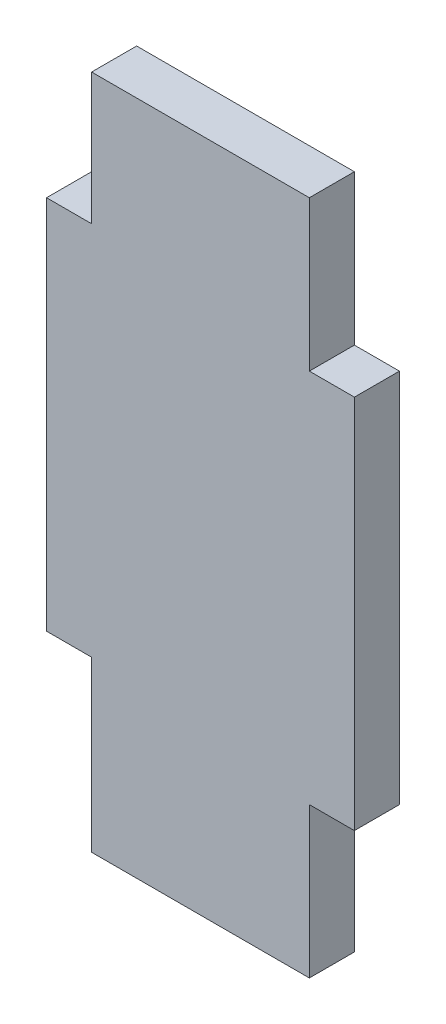
ISO-10303-21;
HEADER;
FILE_DESCRIPTION(('STEP AP214'),'2;1');
FILE_NAME('part.step','',(''),(''),'','','');
FILE_SCHEMA(('AUTOMOTIVE_DESIGN { 1 0 10303 214 1 1 1 1 }'));
ENDSEC;
DATA;
#1=APPLICATION_CONTEXT('core data for automotive mechanical design processes');
#2=APPLICATION_PROTOCOL_DEFINITION('international standard','automotive_design',2000,#1);
#3=PRODUCT_CONTEXT('',#1,'mechanical');
#4=PRODUCT('Part','Part','',(#3));
#5=PRODUCT_RELATED_PRODUCT_CATEGORY('part','',(#4));
#6=PRODUCT_DEFINITION_FORMATION('','',#4);
#7=PRODUCT_DEFINITION_CONTEXT('part definition',#1,'design');
#8=PRODUCT_DEFINITION('design','',#6,#7);
#9=PRODUCT_DEFINITION_SHAPE('','',#8);
#10=(LENGTH_UNIT() NAMED_UNIT(*) SI_UNIT(.MILLI.,.METRE.));
#11=(NAMED_UNIT(*) PLANE_ANGLE_UNIT() SI_UNIT($,.RADIAN.));
#12=(NAMED_UNIT(*) SI_UNIT($,.STERADIAN.) SOLID_ANGLE_UNIT());
#13=UNCERTAINTY_MEASURE_WITH_UNIT(LENGTH_MEASURE(1.E-05),#10,'distance_accuracy_value','');
#14=(GEOMETRIC_REPRESENTATION_CONTEXT(3) GLOBAL_UNCERTAINTY_ASSIGNED_CONTEXT((#13)) GLOBAL_UNIT_ASSIGNED_CONTEXT((#10,
#11,#12)) REPRESENTATION_CONTEXT('',''));
#15=CARTESIAN_POINT('',(0.,0.,0.));
#16=DIRECTION('',(0.,0.,1.));
#17=DIRECTION('',(1.,0.,0.));
#18=AXIS2_PLACEMENT_3D('',#15,#16,#17);
#19=CARTESIAN_POINT('',(-47.7707289927657,27.2916666666667,3.));
#20=DIRECTION('',(1.,0.,0.));
#21=DIRECTION('',(0.,0.,-1.));
#22=AXIS2_PLACEMENT_3D('',#19,#20,#21);
#23=PLANE('',#22);
#24=DIRECTION('',(0.,-1.,0.));
#25=VECTOR('',#24,1.);
#26=CARTESIAN_POINT('',(-47.7707289927657,27.2916666666667,0.));
#27=LINE('',#26,#25);
#28=CARTESIAN_POINT('',(-47.7707289927657,27.2916666666667,0.));
#29=VERTEX_POINT('',#28);
#30=CARTESIAN_POINT('',(-47.7707289927657,18.5416666666667,0.));
#31=VERTEX_POINT('',#30);
#32=EDGE_CURVE('E180',#29,#31,#27,.T.);
#33=ORIENTED_EDGE('',*,*,#32,.T.);
#34=DIRECTION('',(0.,0.,-1.));
#35=VECTOR('',#34,1.);
#36=CARTESIAN_POINT('',(-47.7707289927657,18.5416666666667,3.));
#37=LINE('',#36,#35);
#38=CARTESIAN_POINT('',(-47.7707289927657,18.5416666666667,3.));
#39=VERTEX_POINT('',#38);
#40=EDGE_CURVE('E11',#39,#31,#37,.T.);
#41=ORIENTED_EDGE('',*,*,#40,.F.);
#42=DIRECTION('',(0.,-1.,0.));
#43=VECTOR('',#42,1.);
#44=CARTESIAN_POINT('',(-47.7707289927657,27.2916666666667,3.));
#45=LINE('',#44,#43);
#46=CARTESIAN_POINT('',(-47.7707289927657,27.2916666666667,3.));
#47=VERTEX_POINT('',#46);
#48=EDGE_CURVE('E144',#47,#39,#45,.T.);
#49=ORIENTED_EDGE('',*,*,#48,.F.);
#50=DIRECTION('',(0.,0.,-1.));
#51=VECTOR('',#50,1.);
#52=CARTESIAN_POINT('',(-47.7707289927657,27.2916666666667,3.));
#53=LINE('',#52,#51);
#54=EDGE_CURVE('E151',#47,#29,#53,.T.);
#55=ORIENTED_EDGE('',*,*,#54,.T.);
#56=EDGE_LOOP('',(#33,#41,#49,#55));
#57=FACE_BOUND('',#56,.T.);
#58=ADVANCED_FACE('F33',(#57),#23,.F.);
#59=CARTESIAN_POINT('',(-47.7707289927657,18.5416666666667,3.));
#60=DIRECTION('',(0.,-1.,0.));
#61=DIRECTION('',(1.,0.,0.));
#62=AXIS2_PLACEMENT_3D('',#59,#60,#61);
#63=PLANE('',#62);
#64=DIRECTION('',(-1.,0.,0.));
#65=VECTOR('',#64,1.);
#66=CARTESIAN_POINT('',(-47.7707289927657,18.5416666666667,0.));
#67=LINE('',#66,#65);
#68=CARTESIAN_POINT('',(-50.7707289927657,18.5416666666667,0.));
#69=VERTEX_POINT('',#68);
#70=EDGE_CURVE('E175',#31,#69,#67,.T.);
#71=ORIENTED_EDGE('',*,*,#70,.T.);
#72=DIRECTION('',(0.,0.,-1.));
#73=VECTOR('',#72,1.);
#74=CARTESIAN_POINT('',(-50.7707289927657,18.5416666666667,3.));
#75=LINE('',#74,#73);
#76=CARTESIAN_POINT('',(-50.7707289927657,18.5416666666667,3.));
#77=VERTEX_POINT('',#76);
#78=EDGE_CURVE('E40',#77,#69,#75,.T.);
#79=ORIENTED_EDGE('',*,*,#78,.F.);
#80=DIRECTION('',(-1.,0.,0.));
#81=VECTOR('',#80,1.);
#82=CARTESIAN_POINT('',(-47.7707289927657,18.5416666666667,3.));
#83=LINE('',#82,#81);
#84=EDGE_CURVE('E220',#39,#77,#83,.T.);
#85=ORIENTED_EDGE('',*,*,#84,.F.);
#86=ORIENTED_EDGE('',*,*,#40,.T.);
#87=EDGE_LOOP('',(#71,#79,#85,#86));
#88=FACE_BOUND('',#87,.T.);
#89=ADVANCED_FACE('F258',(#88),#63,.F.);
#90=CARTESIAN_POINT('',(-50.7707289927657,-6.45833333333334,3.));
#91=DIRECTION('',(1.,0.,0.));
#92=DIRECTION('',(0.,0.,-1.));
#93=AXIS2_PLACEMENT_3D('',#90,#91,#92);
#94=PLANE('',#93);
#95=DIRECTION('',(0.,-1.,0.));
#96=VECTOR('',#95,1.);
#97=CARTESIAN_POINT('',(-50.7707289927657,-6.45833333333334,0.));
#98=LINE('',#97,#96);
#99=CARTESIAN_POINT('',(-50.7707289927657,-6.45833333333334,0.));
#100=VERTEX_POINT('',#99);
#101=EDGE_CURVE('E170',#69,#100,#98,.T.);
#102=ORIENTED_EDGE('',*,*,#101,.T.);
#103=DIRECTION('',(0.,0.,-1.));
#104=VECTOR('',#103,1.);
#105=CARTESIAN_POINT('',(-50.7707289927657,-6.45833333333334,3.));
#106=LINE('',#105,#104);
#107=CARTESIAN_POINT('',(-50.7707289927657,-6.45833333333334,3.));
#108=VERTEX_POINT('',#107);
#109=EDGE_CURVE('E161',#108,#100,#106,.T.);
#110=ORIENTED_EDGE('',*,*,#109,.F.);
#111=DIRECTION('',(0.,-1.,0.));
#112=VECTOR('',#111,1.);
#113=CARTESIAN_POINT('',(-50.7707289927657,-6.45833333333334,3.));
#114=LINE('',#113,#112);
#115=EDGE_CURVE('E171',#77,#108,#114,.T.);
#116=ORIENTED_EDGE('',*,*,#115,.F.);
#117=ORIENTED_EDGE('',*,*,#78,.T.);
#118=EDGE_LOOP('',(#102,#110,#116,#117));
#119=FACE_BOUND('',#118,.T.);
#120=ADVANCED_FACE('F168',(#119),#94,.F.);
#121=CARTESIAN_POINT('',(-47.7707289927657,-6.45833333333334,3.));
#122=DIRECTION('',(0.,1.,0.));
#123=DIRECTION('',(0.,0.,1.));
#124=AXIS2_PLACEMENT_3D('',#121,#122,#123);
#125=PLANE('',#124);
#126=DIRECTION('',(1.,0.,0.));
#127=VECTOR('',#126,1.);
#128=CARTESIAN_POINT('',(-47.7707289927657,-6.45833333333334,0.));
#129=LINE('',#128,#127);
#130=CARTESIAN_POINT('',(-47.7707289927657,-6.45833333333334,0.));
#131=VERTEX_POINT('',#130);
#132=EDGE_CURVE('E177',#100,#131,#129,.T.);
#133=ORIENTED_EDGE('',*,*,#132,.T.);
#134=DIRECTION('',(0.,0.,-1.));
#135=VECTOR('',#134,1.);
#136=CARTESIAN_POINT('',(-47.7707289927657,-6.45833333333334,3.));
#137=LINE('',#136,#135);
#138=CARTESIAN_POINT('',(-47.7707289927657,-6.45833333333334,3.));
#139=VERTEX_POINT('',#138);
#140=EDGE_CURVE('E158',#139,#131,#137,.T.);
#141=ORIENTED_EDGE('',*,*,#140,.F.);
#142=DIRECTION('',(1.,0.,0.));
#143=VECTOR('',#142,1.);
#144=CARTESIAN_POINT('',(-47.7707289927657,-6.45833333333334,3.));
#145=LINE('',#144,#143);
#146=EDGE_CURVE('E223',#108,#139,#145,.T.);
#147=ORIENTED_EDGE('',*,*,#146,.F.);
#148=ORIENTED_EDGE('',*,*,#109,.T.);
#149=EDGE_LOOP('',(#133,#141,#147,#148));
#150=FACE_BOUND('',#149,.T.);
#151=ADVANCED_FACE('F265',(#150),#125,.F.);
#152=CARTESIAN_POINT('',(-47.7707289927657,-6.45833333333334,3.));
#153=DIRECTION('',(1.,0.,0.));
#154=DIRECTION('',(0.,0.,-1.));
#155=AXIS2_PLACEMENT_3D('',#152,#153,#154);
#156=PLANE('',#155);
#157=DIRECTION('',(0.,-1.,0.));
#158=VECTOR('',#157,1.);
#159=CARTESIAN_POINT('',(-47.7707289927657,-6.45833333333334,0.));
#160=LINE('',#159,#158);
#161=CARTESIAN_POINT('',(-47.7707289927657,-17.7083333333333,0.));
#162=VERTEX_POINT('',#161);
#163=EDGE_CURVE('E147',#131,#162,#160,.T.);
#164=ORIENTED_EDGE('',*,*,#163,.T.);
#165=DIRECTION('',(0.,0.,-1.));
#166=VECTOR('',#165,1.);
#167=CARTESIAN_POINT('',(-47.7707289927657,-17.7083333333333,3.));
#168=LINE('',#167,#166);
#169=CARTESIAN_POINT('',(-47.7707289927657,-17.7083333333333,3.));
#170=VERTEX_POINT('',#169);
#171=EDGE_CURVE('E154',#170,#162,#168,.T.);
#172=ORIENTED_EDGE('',*,*,#171,.F.);
#173=DIRECTION('',(0.,-1.,0.));
#174=VECTOR('',#173,1.);
#175=CARTESIAN_POINT('',(-47.7707289927657,-6.45833333333334,3.));
#176=LINE('',#175,#174);
#177=EDGE_CURVE('E225',#139,#170,#176,.T.);
#178=ORIENTED_EDGE('',*,*,#177,.F.);
#179=ORIENTED_EDGE('',*,*,#140,.T.);
#180=EDGE_LOOP('',(#164,#172,#178,#179));
#181=FACE_BOUND('',#180,.T.);
#182=ADVANCED_FACE('F185',(#181),#156,.F.);
#183=CARTESIAN_POINT('',(-47.7707289927657,-17.7083333333333,3.));
#184=DIRECTION('',(0.,1.,0.));
#185=DIRECTION('',(-1.,0.,0.));
#186=AXIS2_PLACEMENT_3D('',#183,#184,#185);
#187=PLANE('',#186);
#188=DIRECTION('',(1.,0.,0.));
#189=VECTOR('',#188,1.);
#190=CARTESIAN_POINT('',(-47.7707289927657,-17.7083333333333,0.));
#191=LINE('',#190,#189);
#192=CARTESIAN_POINT('',(-33.2707289927657,-17.7083333333333,0.));
#193=VERTEX_POINT('',#192);
#194=EDGE_CURVE('E142',#162,#193,#191,.T.);
#195=ORIENTED_EDGE('',*,*,#194,.T.);
#196=DIRECTION('',(0.,0.,1.));
#197=VECTOR('',#196,1.);
#198=CARTESIAN_POINT('',(-33.2707289927657,-17.7083333333333,0.));
#199=LINE('',#198,#197);
#200=CARTESIAN_POINT('',(-33.2707289927657,-17.7083333333333,3.));
#201=VERTEX_POINT('',#200);
#202=EDGE_CURVE('E200',#193,#201,#199,.T.);
#203=ORIENTED_EDGE('',*,*,#202,.T.);
#204=DIRECTION('',(1.,0.,0.));
#205=VECTOR('',#204,1.);
#206=CARTESIAN_POINT('',(-47.7707289927657,-17.7083333333333,3.));
#207=LINE('',#206,#205);
#208=EDGE_CURVE('E194',#170,#201,#207,.T.);
#209=ORIENTED_EDGE('',*,*,#208,.F.);
#210=ORIENTED_EDGE('',*,*,#171,.T.);
#211=EDGE_LOOP('',(#195,#203,#209,#210));
#212=FACE_BOUND('',#211,.T.);
#213=ADVANCED_FACE('F191',(#212),#187,.F.);
#214=CARTESIAN_POINT('',(-30.2707289927657,27.2916666666667,3.));
#215=DIRECTION('',(-1.,0.,0.));
#216=DIRECTION('',(0.,-1.,0.));
#217=AXIS2_PLACEMENT_3D('',#214,#215,#216);
#218=PLANE('',#217);
#219=DIRECTION('',(0.,1.,0.));
#220=VECTOR('',#219,1.);
#221=CARTESIAN_POINT('',(-30.2707289927657,27.2916666666667,3.));
#222=LINE('',#221,#220);
#223=CARTESIAN_POINT('',(-30.2707289927657,-7.70833333333333,3.));
#224=VERTEX_POINT('',#223);
#225=CARTESIAN_POINT('',(-30.2707289927657,17.2916666666667,3.));
#226=VERTEX_POINT('',#225);
#227=EDGE_CURVE('E137',#224,#226,#222,.T.);
#228=ORIENTED_EDGE('',*,*,#227,.F.);
#229=DIRECTION('',(0.,0.,1.));
#230=VECTOR('',#229,1.);
#231=CARTESIAN_POINT('',(-30.2707289927657,-7.70833333333333,0.));
#232=LINE('',#231,#230);
#233=CARTESIAN_POINT('',(-30.2707289927657,-7.70833333333333,0.));
#234=VERTEX_POINT('',#233);
#235=EDGE_CURVE('E125',#234,#224,#232,.T.);
#236=ORIENTED_EDGE('',*,*,#235,.F.);
#237=DIRECTION('',(0.,1.,0.));
#238=VECTOR('',#237,1.);
#239=CARTESIAN_POINT('',(-30.2707289927657,27.2916666666667,0.));
#240=LINE('',#239,#238);
#241=CARTESIAN_POINT('',(-30.2707289927657,17.2916666666667,0.));
#242=VERTEX_POINT('',#241);
#243=EDGE_CURVE('E136',#234,#242,#240,.T.);
#244=ORIENTED_EDGE('',*,*,#243,.T.);
#245=DIRECTION('',(0.,0.,1.));
#246=VECTOR('',#245,1.);
#247=CARTESIAN_POINT('',(-30.2707289927657,17.2916666666667,0.));
#248=LINE('',#247,#246);
#249=EDGE_CURVE('E213',#242,#226,#248,.T.);
#250=ORIENTED_EDGE('',*,*,#249,.T.);
#251=EDGE_LOOP('',(#228,#236,#244,#250));
#252=FACE_BOUND('',#251,.T.);
#253=ADVANCED_FACE('F134',(#252),#218,.F.);
#254=CARTESIAN_POINT('',(-47.7707289927657,27.2916666666667,3.));
#255=DIRECTION('',(0.,-1.,0.));
#256=DIRECTION('',(0.,0.,-1.));
#257=AXIS2_PLACEMENT_3D('',#254,#255,#256);
#258=PLANE('',#257);
#259=DIRECTION('',(-1.,0.,0.));
#260=VECTOR('',#259,1.);
#261=CARTESIAN_POINT('',(-47.7707289927657,27.2916666666667,3.));
#262=LINE('',#261,#260);
#263=CARTESIAN_POINT('',(-33.2707289927657,27.2916666666667,3.));
#264=VERTEX_POINT('',#263);
#265=EDGE_CURVE('E155',#264,#47,#262,.T.);
#266=ORIENTED_EDGE('',*,*,#265,.F.);
#267=DIRECTION('',(0.,0.,1.));
#268=VECTOR('',#267,1.);
#269=CARTESIAN_POINT('',(-33.2707289927657,27.2916666666667,0.));
#270=LINE('',#269,#268);
#271=CARTESIAN_POINT('',(-33.2707289927657,27.2916666666667,0.));
#272=VERTEX_POINT('',#271);
#273=EDGE_CURVE('E208',#272,#264,#270,.T.);
#274=ORIENTED_EDGE('',*,*,#273,.F.);
#275=DIRECTION('',(-1.,0.,0.));
#276=VECTOR('',#275,1.);
#277=CARTESIAN_POINT('',(-47.7707289927657,27.2916666666667,0.));
#278=LINE('',#277,#276);
#279=EDGE_CURVE('E141',#272,#29,#278,.T.);
#280=ORIENTED_EDGE('',*,*,#279,.T.);
#281=ORIENTED_EDGE('',*,*,#54,.F.);
#282=EDGE_LOOP('',(#266,#274,#280,#281));
#283=FACE_BOUND('',#282,.T.);
#284=ADVANCED_FACE('F238',(#283),#258,.F.);
#285=CARTESIAN_POINT('',(0.,0.,3.));
#286=DIRECTION('',(0.,0.,-1.));
#287=DIRECTION('',(-1.,0.,0.));
#288=AXIS2_PLACEMENT_3D('',#285,#286,#287);
#289=PLANE('',#288);
#290=ORIENTED_EDGE('',*,*,#208,.T.);
#291=DIRECTION('',(0.,-1.,0.));
#292=VECTOR('',#291,1.);
#293=CARTESIAN_POINT('',(-33.2707289927657,-17.7083333333333,3.));
#294=LINE('',#293,#292);
#295=CARTESIAN_POINT('',(-33.2707289927657,-7.70833333333333,3.));
#296=VERTEX_POINT('',#295);
#297=EDGE_CURVE('E130',#296,#201,#294,.T.);
#298=ORIENTED_EDGE('',*,*,#297,.F.);
#299=DIRECTION('',(-1.,0.,0.));
#300=VECTOR('',#299,1.);
#301=CARTESIAN_POINT('',(-30.2707289927657,-7.70833333333333,3.));
#302=LINE('',#301,#300);
#303=EDGE_CURVE('E197',#224,#296,#302,.T.);
#304=ORIENTED_EDGE('',*,*,#303,.F.);
#305=ORIENTED_EDGE('',*,*,#227,.T.);
#306=DIRECTION('',(1.,0.,0.));
#307=VECTOR('',#306,1.);
#308=CARTESIAN_POINT('',(-30.2707289927657,17.2916666666667,3.));
#309=LINE('',#308,#307);
#310=CARTESIAN_POINT('',(-33.2707289927657,17.2916666666667,3.));
#311=VERTEX_POINT('',#310);
#312=EDGE_CURVE('E206',#311,#226,#309,.T.);
#313=ORIENTED_EDGE('',*,*,#312,.F.);
#314=DIRECTION('',(0.,-1.,0.));
#315=VECTOR('',#314,1.);
#316=CARTESIAN_POINT('',(-33.2707289927657,27.2916666666667,3.));
#317=LINE('',#316,#315);
#318=EDGE_CURVE('E202',#264,#311,#317,.T.);
#319=ORIENTED_EDGE('',*,*,#318,.F.);
#320=ORIENTED_EDGE('',*,*,#265,.T.);
#321=ORIENTED_EDGE('',*,*,#48,.T.);
#322=ORIENTED_EDGE('',*,*,#84,.T.);
#323=ORIENTED_EDGE('',*,*,#115,.T.);
#324=ORIENTED_EDGE('',*,*,#146,.T.);
#325=ORIENTED_EDGE('',*,*,#177,.T.);
#326=EDGE_LOOP('',(#290,#298,#304,#305,#313,#319,#320,#321,#322,#323,#324,#325));
#327=FACE_BOUND('',#326,.T.);
#328=ADVANCED_FACE('F244',(#327),#289,.F.);
#329=CARTESIAN_POINT('',(0.,0.,0.));
#330=DIRECTION('',(0.,0.,-1.));
#331=DIRECTION('',(-1.,0.,0.));
#332=AXIS2_PLACEMENT_3D('',#329,#330,#331);
#333=PLANE('',#332);
#334=DIRECTION('',(0.,-1.,0.));
#335=VECTOR('',#334,1.);
#336=CARTESIAN_POINT('',(-33.2707289927657,-17.7083333333333,0.));
#337=LINE('',#336,#335);
#338=CARTESIAN_POINT('',(-33.2707289927657,-7.70833333333333,0.));
#339=VERTEX_POINT('',#338);
#340=EDGE_CURVE('E47',#339,#193,#337,.T.);
#341=ORIENTED_EDGE('',*,*,#340,.T.);
#342=ORIENTED_EDGE('',*,*,#194,.F.);
#343=ORIENTED_EDGE('',*,*,#163,.F.);
#344=ORIENTED_EDGE('',*,*,#132,.F.);
#345=ORIENTED_EDGE('',*,*,#101,.F.);
#346=ORIENTED_EDGE('',*,*,#70,.F.);
#347=ORIENTED_EDGE('',*,*,#32,.F.);
#348=ORIENTED_EDGE('',*,*,#279,.F.);
#349=DIRECTION('',(0.,-1.,0.));
#350=VECTOR('',#349,1.);
#351=CARTESIAN_POINT('',(-33.2707289927657,27.2916666666667,0.));
#352=LINE('',#351,#350);
#353=CARTESIAN_POINT('',(-33.2707289927657,17.2916666666667,0.));
#354=VERTEX_POINT('',#353);
#355=EDGE_CURVE('E204',#272,#354,#352,.T.);
#356=ORIENTED_EDGE('',*,*,#355,.T.);
#357=DIRECTION('',(1.,0.,0.));
#358=VECTOR('',#357,1.);
#359=CARTESIAN_POINT('',(-30.2707289927657,17.2916666666667,0.));
#360=LINE('',#359,#358);
#361=EDGE_CURVE('E55',#354,#242,#360,.T.);
#362=ORIENTED_EDGE('',*,*,#361,.T.);
#363=ORIENTED_EDGE('',*,*,#243,.F.);
#364=DIRECTION('',(-1.,0.,0.));
#365=VECTOR('',#364,1.);
#366=CARTESIAN_POINT('',(-30.2707289927657,-7.70833333333333,0.));
#367=LINE('',#366,#365);
#368=EDGE_CURVE('E121',#234,#339,#367,.T.);
#369=ORIENTED_EDGE('',*,*,#368,.T.);
#370=EDGE_LOOP('',(#341,#342,#343,#344,#345,#346,#347,#348,#356,#362,#363,#369));
#371=FACE_BOUND('',#370,.T.);
#372=ADVANCED_FACE('F139',(#371),#333,.T.);
#373=CARTESIAN_POINT('',(-30.2707289927657,17.2916666666667,0.));
#374=DIRECTION('',(0.,-1.,0.));
#375=DIRECTION('',(0.,0.,-1.));
#376=AXIS2_PLACEMENT_3D('',#373,#374,#375);
#377=PLANE('',#376);
#378=ORIENTED_EDGE('',*,*,#312,.T.);
#379=ORIENTED_EDGE('',*,*,#249,.F.);
#380=ORIENTED_EDGE('',*,*,#361,.F.);
#381=DIRECTION('',(0.,0.,1.));
#382=VECTOR('',#381,1.);
#383=CARTESIAN_POINT('',(-33.2707289927657,17.2916666666667,0.));
#384=LINE('',#383,#382);
#385=EDGE_CURVE('E215',#354,#311,#384,.T.);
#386=ORIENTED_EDGE('',*,*,#385,.T.);
#387=EDGE_LOOP('',(#378,#379,#380,#386));
#388=FACE_BOUND('',#387,.T.);
#389=ADVANCED_FACE('F245',(#388),#377,.F.);
#390=CARTESIAN_POINT('',(-33.2707289927657,27.2916666666667,0.));
#391=DIRECTION('',(-1.,0.,0.));
#392=DIRECTION('',(0.,0.,1.));
#393=AXIS2_PLACEMENT_3D('',#390,#391,#392);
#394=PLANE('',#393);
#395=ORIENTED_EDGE('',*,*,#318,.T.);
#396=ORIENTED_EDGE('',*,*,#385,.F.);
#397=ORIENTED_EDGE('',*,*,#355,.F.);
#398=ORIENTED_EDGE('',*,*,#273,.T.);
#399=EDGE_LOOP('',(#395,#396,#397,#398));
#400=FACE_BOUND('',#399,.T.);
#401=ADVANCED_FACE('F241',(#400),#394,.F.);
#402=CARTESIAN_POINT('',(-33.2707289927657,-17.7083333333333,0.));
#403=DIRECTION('',(-1.,0.,0.));
#404=DIRECTION('',(0.,0.,1.));
#405=AXIS2_PLACEMENT_3D('',#402,#403,#404);
#406=PLANE('',#405);
#407=ORIENTED_EDGE('',*,*,#297,.T.);
#408=ORIENTED_EDGE('',*,*,#202,.F.);
#409=ORIENTED_EDGE('',*,*,#340,.F.);
#410=DIRECTION('',(0.,0.,1.));
#411=VECTOR('',#410,1.);
#412=CARTESIAN_POINT('',(-33.2707289927657,-7.70833333333333,0.));
#413=LINE('',#412,#411);
#414=EDGE_CURVE('E127',#339,#296,#413,.T.);
#415=ORIENTED_EDGE('',*,*,#414,.T.);
#416=EDGE_LOOP('',(#407,#408,#409,#415));
#417=FACE_BOUND('',#416,.T.);
#418=ADVANCED_FACE('F252',(#417),#406,.F.);
#419=CARTESIAN_POINT('',(-30.2707289927657,-7.70833333333333,0.));
#420=DIRECTION('',(0.,1.,0.));
#421=DIRECTION('',(-1.,0.,0.));
#422=AXIS2_PLACEMENT_3D('',#419,#420,#421);
#423=PLANE('',#422);
#424=ORIENTED_EDGE('',*,*,#303,.T.);
#425=ORIENTED_EDGE('',*,*,#414,.F.);
#426=ORIENTED_EDGE('',*,*,#368,.F.);
#427=ORIENTED_EDGE('',*,*,#235,.T.);
#428=EDGE_LOOP('',(#424,#425,#426,#427));
#429=FACE_BOUND('',#428,.T.);
#430=ADVANCED_FACE('F124',(#429),#423,.F.);
#431=CLOSED_SHELL('',(#58,#89,#120,#151,#182,#213,#253,#284,#328,#372,#389,#401,#418,#430));
#432=MANIFOLD_SOLID_BREP('B2',#431);
#433=ADVANCED_BREP_SHAPE_REPRESENTATION('',(#18,#432),#14);
#434=SHAPE_DEFINITION_REPRESENTATION(#9,#433);
ENDSEC;
END-ISO-10303-21;
